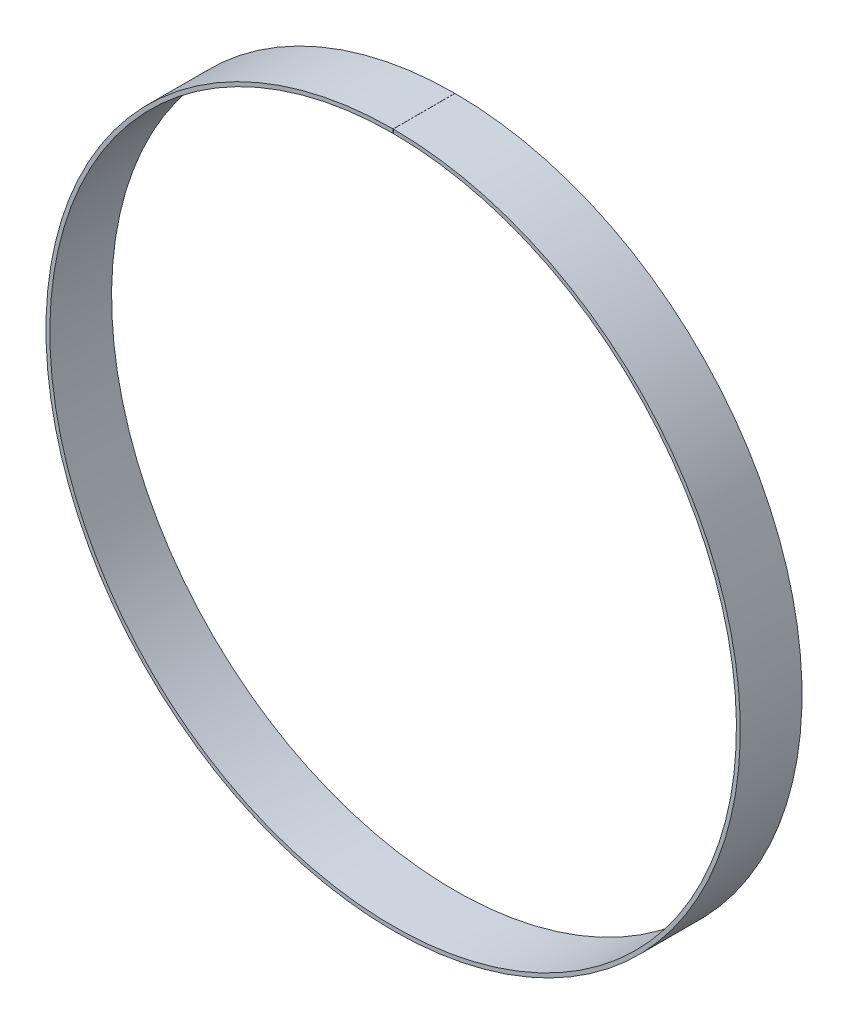
ISO-10303-21;
HEADER;
FILE_DESCRIPTION(('STEP AP214'),'2;1');
FILE_NAME('part.step','',(''),(''),'','','');
FILE_SCHEMA(('AUTOMOTIVE_DESIGN { 1 0 10303 214 1 1 1 1 }'));
ENDSEC;
DATA;
#1=APPLICATION_CONTEXT('core data for automotive mechanical design processes');
#2=APPLICATION_PROTOCOL_DEFINITION('international standard','automotive_design',2000,#1);
#3=PRODUCT_CONTEXT('',#1,'mechanical');
#4=PRODUCT('Part','Part','',(#3));
#5=PRODUCT_RELATED_PRODUCT_CATEGORY('part','',(#4));
#6=PRODUCT_DEFINITION_FORMATION('','',#4);
#7=PRODUCT_DEFINITION_CONTEXT('part definition',#1,'design');
#8=PRODUCT_DEFINITION('design','',#6,#7);
#9=PRODUCT_DEFINITION_SHAPE('','',#8);
#10=(LENGTH_UNIT() NAMED_UNIT(*) SI_UNIT(.MILLI.,.METRE.));
#11=(NAMED_UNIT(*) PLANE_ANGLE_UNIT() SI_UNIT($,.RADIAN.));
#12=(NAMED_UNIT(*) SI_UNIT($,.STERADIAN.) SOLID_ANGLE_UNIT());
#13=UNCERTAINTY_MEASURE_WITH_UNIT(LENGTH_MEASURE(1.E-05),#10,'distance_accuracy_value','');
#14=(GEOMETRIC_REPRESENTATION_CONTEXT(3) GLOBAL_UNCERTAINTY_ASSIGNED_CONTEXT((#13)) GLOBAL_UNIT_ASSIGNED_CONTEXT((#10,
#11,#12)) REPRESENTATION_CONTEXT('',''));
#15=CARTESIAN_POINT('',(0.,0.,0.));
#16=DIRECTION('',(0.,0.,1.));
#17=DIRECTION('',(1.,0.,0.));
#18=AXIS2_PLACEMENT_3D('',#15,#16,#17);
#19=CARTESIAN_POINT('',(0.,0.,100.));
#20=DIRECTION('',(0.,0.,-1.));
#21=DIRECTION('',(-1.,0.,0.));
#22=AXIS2_PLACEMENT_3D('',#19,#20,#21);
#23=CYLINDRICAL_SURFACE('',#22,445.);
#24=DIRECTION('',(0.,0.,-1.));
#25=VECTOR('',#24,1.);
#26=CARTESIAN_POINT('',(0.197777777777688,444.999956049381,100.));
#27=LINE('',#26,#25);
#28=CARTESIAN_POINT('',(0.197777777777688,444.999956049381,100.));
#29=VERTEX_POINT('',#28);
#30=CARTESIAN_POINT('',(0.197777777777688,444.999956049381,20.));
#31=VERTEX_POINT('',#30);
#32=EDGE_CURVE('E57',#29,#31,#27,.T.);
#33=ORIENTED_EDGE('',*,*,#32,.T.);
#34=CARTESIAN_POINT('',(0.,0.,20.));
#35=DIRECTION('',(0.,0.,1.));
#36=DIRECTION('',(1.,0.,0.));
#37=AXIS2_PLACEMENT_3D('',#34,#35,#36);
#38=CIRCLE('',#37,445.);
#39=CARTESIAN_POINT('',(4.67131130328806E-12,445.,20.));
#40=VERTEX_POINT('',#39);
#41=EDGE_CURVE('E97',#31,#40,#38,.F.);
#42=ORIENTED_EDGE('',*,*,#41,.T.);
#43=DIRECTION('',(0.,0.,-1.));
#44=VECTOR('',#43,1.);
#45=CARTESIAN_POINT('',(4.67131130328806E-12,445.,100.));
#46=LINE('',#45,#44);
#47=CARTESIAN_POINT('',(4.67131130328806E-12,445.,100.));
#48=VERTEX_POINT('',#47);
#49=EDGE_CURVE('E11',#48,#40,#46,.T.);
#50=ORIENTED_EDGE('',*,*,#49,.F.);
#51=CARTESIAN_POINT('',(0.,0.,100.));
#52=DIRECTION('',(0.,0.,1.));
#53=DIRECTION('',(1.,0.,0.));
#54=AXIS2_PLACEMENT_3D('',#51,#52,#53);
#55=CIRCLE('',#54,445.);
#56=EDGE_CURVE('E111',#29,#48,#55,.F.);
#57=ORIENTED_EDGE('',*,*,#56,.F.);
#58=EDGE_LOOP('',(#33,#42,#50,#57));
#59=FACE_BOUND('',#58,.T.);
#60=ADVANCED_FACE('F42',(#59),#23,.F.);
#61=CARTESIAN_POINT('',(4.76860891339986E-12,450.,100.));
#62=DIRECTION('',(1.,0.,0.));
#63=DIRECTION('',(0.,1.,0.));
#64=AXIS2_PLACEMENT_3D('',#61,#62,#63);
#65=PLANE('',#64);
#66=ORIENTED_EDGE('',*,*,#49,.T.);
#67=DIRECTION('',(0.,-1.,0.));
#68=VECTOR('',#67,1.);
#69=CARTESIAN_POINT('',(4.76860891339986E-12,450.,20.));
#70=LINE('',#69,#68);
#71=CARTESIAN_POINT('',(4.76860891339986E-12,450.,20.));
#72=VERTEX_POINT('',#71);
#73=EDGE_CURVE('E87',#72,#40,#70,.T.);
#74=ORIENTED_EDGE('',*,*,#73,.F.);
#75=DIRECTION('',(0.,0.,-1.));
#76=VECTOR('',#75,1.);
#77=CARTESIAN_POINT('',(4.76860891339986E-12,450.,100.));
#78=LINE('',#77,#76);
#79=CARTESIAN_POINT('',(4.76860891339986E-12,450.,100.));
#80=VERTEX_POINT('',#79);
#81=EDGE_CURVE('E50',#80,#72,#78,.T.);
#82=ORIENTED_EDGE('',*,*,#81,.F.);
#83=DIRECTION('',(0.,-1.,0.));
#84=VECTOR('',#83,1.);
#85=CARTESIAN_POINT('',(4.76860891339986E-12,450.,100.));
#86=LINE('',#85,#84);
#87=EDGE_CURVE('E89',#80,#48,#86,.T.);
#88=ORIENTED_EDGE('',*,*,#87,.T.);
#89=EDGE_LOOP('',(#66,#74,#82,#88));
#90=FACE_BOUND('',#89,.T.);
#91=ADVANCED_FACE('F86',(#90),#65,.T.);
#92=CARTESIAN_POINT('',(0.,0.,100.));
#93=DIRECTION('',(0.,0.,-1.));
#94=DIRECTION('',(-1.,0.,0.));
#95=AXIS2_PLACEMENT_3D('',#92,#93,#94);
#96=CYLINDRICAL_SURFACE('',#95,450.);
#97=ORIENTED_EDGE('',*,*,#81,.T.);
#98=CARTESIAN_POINT('',(0.,0.,20.));
#99=DIRECTION('',(0.,0.,-1.));
#100=DIRECTION('',(-1.,0.,0.));
#101=AXIS2_PLACEMENT_3D('',#98,#99,#100);
#102=CIRCLE('',#101,450.);
#103=CARTESIAN_POINT('',(0.199999999999954,449.999955555553,20.));
#104=VERTEX_POINT('',#103);
#105=EDGE_CURVE('E98',#104,#72,#102,.T.);
#106=ORIENTED_EDGE('',*,*,#105,.F.);
#107=DIRECTION('',(0.,0.,-1.));
#108=VECTOR('',#107,1.);
#109=CARTESIAN_POINT('',(0.199999999999954,449.999955555553,100.));
#110=LINE('',#109,#108);
#111=CARTESIAN_POINT('',(0.199999999999954,449.999955555553,100.));
#112=VERTEX_POINT('',#111);
#113=EDGE_CURVE('E65',#112,#104,#110,.T.);
#114=ORIENTED_EDGE('',*,*,#113,.F.);
#115=CARTESIAN_POINT('',(0.,0.,100.));
#116=DIRECTION('',(0.,0.,-1.));
#117=DIRECTION('',(-1.,0.,0.));
#118=AXIS2_PLACEMENT_3D('',#115,#116,#117);
#119=CIRCLE('',#118,450.);
#120=EDGE_CURVE('E116',#112,#80,#119,.T.);
#121=ORIENTED_EDGE('',*,*,#120,.T.);
#122=EDGE_LOOP('',(#97,#106,#114,#121));
#123=FACE_BOUND('',#122,.T.);
#124=ADVANCED_FACE('F126',(#123),#96,.T.);
#125=CARTESIAN_POINT('',(0.197777777777688,444.999956049381,100.));
#126=DIRECTION('',(-0.999999901234563,0.000444444444453206,0.));
#127=DIRECTION('',(-0.000444444444453206,-0.999999901234563,0.));
#128=AXIS2_PLACEMENT_3D('',#125,#126,#127);
#129=PLANE('',#128);
#130=ORIENTED_EDGE('',*,*,#113,.T.);
#131=DIRECTION('',(0.000444444444453206,0.999999901234563,0.));
#132=VECTOR('',#131,1.);
#133=CARTESIAN_POINT('',(0.197777777777688,444.999956049381,20.));
#134=LINE('',#133,#132);
#135=EDGE_CURVE('E108',#31,#104,#134,.T.);
#136=ORIENTED_EDGE('',*,*,#135,.F.);
#137=ORIENTED_EDGE('',*,*,#32,.F.);
#138=DIRECTION('',(0.000444444444453206,0.999999901234563,0.));
#139=VECTOR('',#138,1.);
#140=CARTESIAN_POINT('',(0.197777777777688,444.999956049381,100.));
#141=LINE('',#140,#139);
#142=EDGE_CURVE('E119',#29,#112,#141,.T.);
#143=ORIENTED_EDGE('',*,*,#142,.T.);
#144=EDGE_LOOP('',(#130,#136,#137,#143));
#145=FACE_BOUND('',#144,.T.);
#146=ADVANCED_FACE('F130',(#145),#129,.T.);
#147=CARTESIAN_POINT('',(0.,0.,100.));
#148=DIRECTION('',(0.,0.,1.));
#149=DIRECTION('',(1.,0.,0.));
#150=AXIS2_PLACEMENT_3D('',#147,#148,#149);
#151=PLANE('',#150);
#152=ORIENTED_EDGE('',*,*,#56,.T.);
#153=ORIENTED_EDGE('',*,*,#87,.F.);
#154=ORIENTED_EDGE('',*,*,#120,.F.);
#155=ORIENTED_EDGE('',*,*,#142,.F.);
#156=EDGE_LOOP('',(#152,#153,#154,#155));
#157=FACE_BOUND('',#156,.T.);
#158=ADVANCED_FACE('F128',(#157),#151,.T.);
#159=CARTESIAN_POINT('',(0.,0.,20.));
#160=DIRECTION('',(0.,0.,1.));
#161=DIRECTION('',(1.,0.,0.));
#162=AXIS2_PLACEMENT_3D('',#159,#160,#161);
#163=PLANE('',#162);
#164=ORIENTED_EDGE('',*,*,#41,.F.);
#165=ORIENTED_EDGE('',*,*,#135,.T.);
#166=ORIENTED_EDGE('',*,*,#105,.T.);
#167=ORIENTED_EDGE('',*,*,#73,.T.);
#168=EDGE_LOOP('',(#164,#165,#166,#167));
#169=FACE_BOUND('',#168,.T.);
#170=ADVANCED_FACE('F95',(#169),#163,.F.);
#171=CLOSED_SHELL('',(#60,#91,#124,#146,#158,#170));
#172=MANIFOLD_SOLID_BREP('B2',#171);
#173=ADVANCED_BREP_SHAPE_REPRESENTATION('',(#18,#172),#14);
#174=SHAPE_DEFINITION_REPRESENTATION(#9,#173);
ENDSEC;
END-ISO-10303-21;
